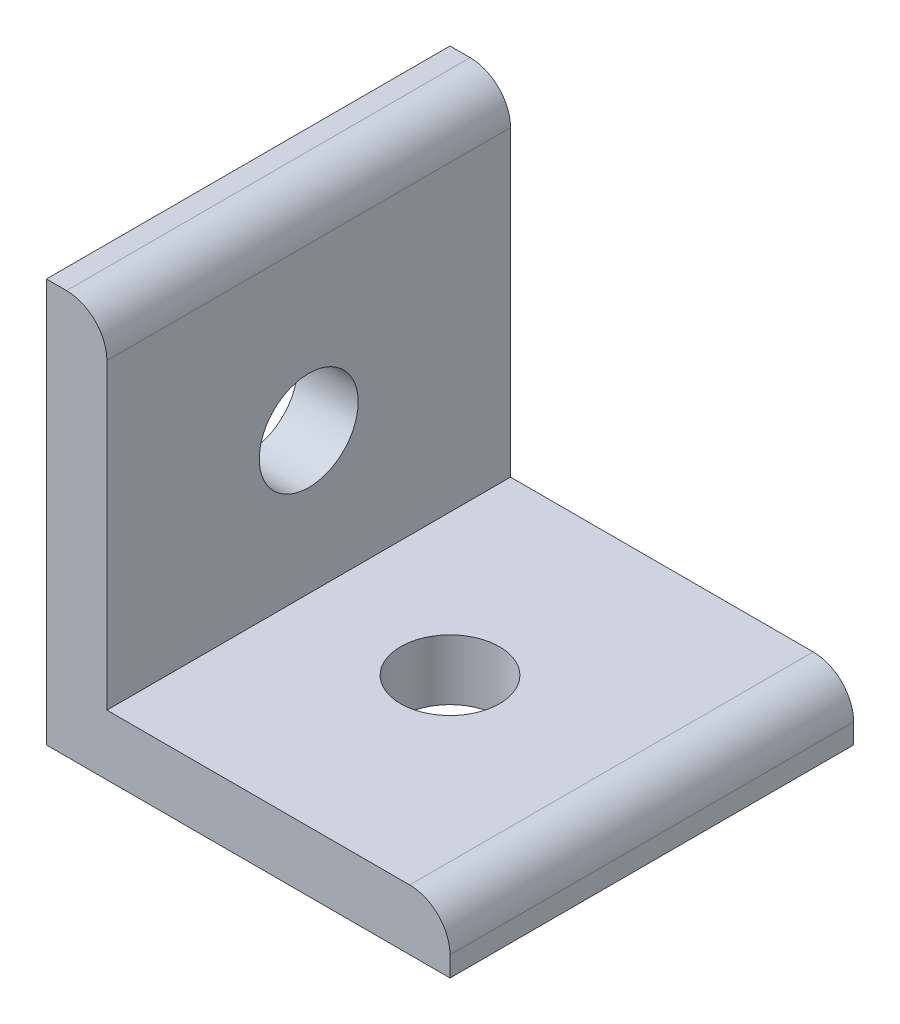
ISO-10303-21;
HEADER;
FILE_DESCRIPTION(('STEP AP214'),'2;1');
FILE_NAME('part.step','',(''),(''),'','','');
FILE_SCHEMA(('AUTOMOTIVE_DESIGN { 1 0 10303 214 1 1 1 1 }'));
ENDSEC;
DATA;
#1=APPLICATION_CONTEXT('core data for automotive mechanical design processes');
#2=APPLICATION_PROTOCOL_DEFINITION('international standard','automotive_design',2000,#1);
#3=PRODUCT_CONTEXT('',#1,'mechanical');
#4=PRODUCT('Part','Part','',(#3));
#5=PRODUCT_RELATED_PRODUCT_CATEGORY('part','',(#4));
#6=PRODUCT_DEFINITION_FORMATION('','',#4);
#7=PRODUCT_DEFINITION_CONTEXT('part definition',#1,'design');
#8=PRODUCT_DEFINITION('design','',#6,#7);
#9=PRODUCT_DEFINITION_SHAPE('','',#8);
#10=(LENGTH_UNIT() NAMED_UNIT(*) SI_UNIT(.MILLI.,.METRE.));
#11=(NAMED_UNIT(*) PLANE_ANGLE_UNIT() SI_UNIT($,.RADIAN.));
#12=(NAMED_UNIT(*) SI_UNIT($,.STERADIAN.) SOLID_ANGLE_UNIT());
#13=UNCERTAINTY_MEASURE_WITH_UNIT(LENGTH_MEASURE(1.E-05),#10,'distance_accuracy_value','');
#14=(GEOMETRIC_REPRESENTATION_CONTEXT(3) GLOBAL_UNCERTAINTY_ASSIGNED_CONTEXT((#13)) GLOBAL_UNIT_ASSIGNED_CONTEXT((#10,
#11,#12)) REPRESENTATION_CONTEXT('',''));
#15=CARTESIAN_POINT('',(0.,0.,0.));
#16=DIRECTION('',(0.,0.,1.));
#17=DIRECTION('',(1.,0.,0.));
#18=AXIS2_PLACEMENT_3D('',#15,#16,#17);
#19=CARTESIAN_POINT('',(0.,0.,20.));
#20=DIRECTION('',(1.,0.,0.));
#21=DIRECTION('',(0.,0.,-1.));
#22=AXIS2_PLACEMENT_3D('',#19,#20,#21);
#23=PLANE('',#22);
#24=CARTESIAN_POINT('',(0.,9.99686990070358,10.));
#25=DIRECTION('',(1.,0.,0.));
#26=DIRECTION('',(0.,0.,-1.));
#27=AXIS2_PLACEMENT_3D('',#24,#25,#26);
#28=CIRCLE('',#27,2.45);
#29=CARTESIAN_POINT('',(0.,9.99686990070358,7.55));
#30=VERTEX_POINT('',#29);
#31=EDGE_CURVE('E174',#30,#30,#28,.F.);
#32=ORIENTED_EDGE('',*,*,#31,.F.);
#33=EDGE_LOOP('',(#32));
#34=FACE_BOUND('',#33,.T.);
#35=DIRECTION('',(0.,-1.,0.));
#36=VECTOR('',#35,1.);
#37=CARTESIAN_POINT('',(0.,0.,0.));
#38=LINE('',#37,#36);
#39=CARTESIAN_POINT('',(0.,19.9968699007036,0.));
#40=VERTEX_POINT('',#39);
#41=CARTESIAN_POINT('',(0.,0.,0.));
#42=VERTEX_POINT('',#41);
#43=EDGE_CURVE('E121',#40,#42,#38,.T.);
#44=ORIENTED_EDGE('',*,*,#43,.T.);
#45=DIRECTION('',(0.,0.,-1.));
#46=VECTOR('',#45,1.);
#47=CARTESIAN_POINT('',(0.,0.,20.));
#48=LINE('',#47,#46);
#49=CARTESIAN_POINT('',(0.,0.,20.));
#50=VERTEX_POINT('',#49);
#51=EDGE_CURVE('E103',#50,#42,#48,.T.);
#52=ORIENTED_EDGE('',*,*,#51,.F.);
#53=DIRECTION('',(0.,-1.,0.));
#54=VECTOR('',#53,1.);
#55=CARTESIAN_POINT('',(0.,0.,20.));
#56=LINE('',#55,#54);
#57=CARTESIAN_POINT('',(0.,19.9968699007036,20.));
#58=VERTEX_POINT('',#57);
#59=EDGE_CURVE('E109',#58,#50,#56,.T.);
#60=ORIENTED_EDGE('',*,*,#59,.F.);
#61=DIRECTION('',(0.,0.,-1.));
#62=VECTOR('',#61,1.);
#63=CARTESIAN_POINT('',(0.,19.9968699007036,20.));
#64=LINE('',#63,#62);
#65=EDGE_CURVE('E161',#58,#40,#64,.T.);
#66=ORIENTED_EDGE('',*,*,#65,.T.);
#67=EDGE_LOOP('',(#44,#52,#60,#66));
#68=FACE_BOUND('',#67,.T.);
#69=ADVANCED_FACE('F34',(#34,#68),#23,.F.);
#70=CARTESIAN_POINT('',(0.,0.,20.));
#71=DIRECTION('',(0.,1.,0.));
#72=DIRECTION('',(0.,0.,1.));
#73=AXIS2_PLACEMENT_3D('',#70,#71,#72);
#74=PLANE('',#73);
#75=CARTESIAN_POINT('',(10.0015933342515,0.,10.));
#76=DIRECTION('',(0.,1.,0.));
#77=DIRECTION('',(0.,0.,1.));
#78=AXIS2_PLACEMENT_3D('',#75,#76,#77);
#79=CIRCLE('',#78,2.45);
#80=CARTESIAN_POINT('',(10.0015933342515,0.,12.45));
#81=VERTEX_POINT('',#80);
#82=EDGE_CURVE('E182',#81,#81,#79,.F.);
#83=ORIENTED_EDGE('',*,*,#82,.F.);
#84=EDGE_LOOP('',(#83));
#85=FACE_BOUND('',#84,.T.);
#86=DIRECTION('',(1.,0.,0.));
#87=VECTOR('',#86,1.);
#88=CARTESIAN_POINT('',(0.,0.,0.));
#89=LINE('',#88,#87);
#90=CARTESIAN_POINT('',(20.0015933342515,0.,0.));
#91=VERTEX_POINT('',#90);
#92=EDGE_CURVE('E156',#42,#91,#89,.T.);
#93=ORIENTED_EDGE('',*,*,#92,.T.);
#94=DIRECTION('',(0.,0.,-1.));
#95=VECTOR('',#94,1.);
#96=CARTESIAN_POINT('',(20.0015933342515,0.,20.));
#97=LINE('',#96,#95);
#98=CARTESIAN_POINT('',(20.0015933342515,0.,20.));
#99=VERTEX_POINT('',#98);
#100=EDGE_CURVE('E106',#99,#91,#97,.T.);
#101=ORIENTED_EDGE('',*,*,#100,.F.);
#102=DIRECTION('',(1.,0.,0.));
#103=VECTOR('',#102,1.);
#104=CARTESIAN_POINT('',(0.,0.,20.));
#105=LINE('',#104,#103);
#106=EDGE_CURVE('E99',#50,#99,#105,.T.);
#107=ORIENTED_EDGE('',*,*,#106,.F.);
#108=ORIENTED_EDGE('',*,*,#51,.T.);
#109=EDGE_LOOP('',(#93,#101,#107,#108));
#110=FACE_BOUND('',#109,.T.);
#111=ADVANCED_FACE('F101',(#85,#110),#74,.F.);
#112=CARTESIAN_POINT('',(20.0015933342515,2.99443825189407,20.));
#113=DIRECTION('',(-1.,0.,0.));
#114=DIRECTION('',(0.,0.,1.));
#115=AXIS2_PLACEMENT_3D('',#112,#113,#114);
#116=PLANE('',#115);
#117=DIRECTION('',(0.,1.,0.));
#118=VECTOR('',#117,1.);
#119=CARTESIAN_POINT('',(20.0015933342515,2.99443825189407,0.));
#120=LINE('',#119,#118);
#121=CARTESIAN_POINT('',(20.0015933342515,0.994438251894074,0.));
#122=VERTEX_POINT('',#121);
#123=EDGE_CURVE('E153',#91,#122,#120,.T.);
#124=ORIENTED_EDGE('',*,*,#123,.T.);
#125=DIRECTION('',(0.,0.,-1.));
#126=VECTOR('',#125,1.);
#127=CARTESIAN_POINT('',(20.0015933342515,0.994438251894074,20.));
#128=LINE('',#127,#126);
#129=CARTESIAN_POINT('',(20.0015933342515,0.994438251894074,20.));
#130=VERTEX_POINT('',#129);
#131=EDGE_CURVE('E42',#122,#130,#128,.F.);
#132=ORIENTED_EDGE('',*,*,#131,.T.);
#133=DIRECTION('',(0.,1.,0.));
#134=VECTOR('',#133,1.);
#135=CARTESIAN_POINT('',(20.0015933342515,2.99443825189407,20.));
#136=LINE('',#135,#134);
#137=EDGE_CURVE('E108',#99,#130,#136,.T.);
#138=ORIENTED_EDGE('',*,*,#137,.F.);
#139=ORIENTED_EDGE('',*,*,#100,.T.);
#140=EDGE_LOOP('',(#124,#132,#138,#139));
#141=FACE_BOUND('',#140,.T.);
#142=ADVANCED_FACE('F175',(#141),#116,.F.);
#143=CARTESIAN_POINT('',(2.999161685442,2.99443825189407,20.));
#144=DIRECTION('',(0.,-1.,0.));
#145=DIRECTION('',(0.,0.,-1.));
#146=AXIS2_PLACEMENT_3D('',#143,#144,#145);
#147=PLANE('',#146);
#148=CARTESIAN_POINT('',(10.0015933342515,2.99443825189407,10.));
#149=DIRECTION('',(0.,1.,0.));
#150=DIRECTION('',(0.,0.,1.));
#151=AXIS2_PLACEMENT_3D('',#148,#149,#150);
#152=CIRCLE('',#151,2.45);
#153=CARTESIAN_POINT('',(10.0015933342515,2.99443825189407,12.45));
#154=VERTEX_POINT('',#153);
#155=EDGE_CURVE('E185',#154,#154,#152,.T.);
#156=ORIENTED_EDGE('',*,*,#155,.F.);
#157=EDGE_LOOP('',(#156));
#158=FACE_BOUND('',#157,.T.);
#159=DIRECTION('',(-1.,0.,0.));
#160=VECTOR('',#159,1.);
#161=CARTESIAN_POINT('',(2.999161685442,2.99443825189407,20.));
#162=LINE('',#161,#160);
#163=CARTESIAN_POINT('',(18.0015933342515,2.99443825189407,20.));
#164=VERTEX_POINT('',#163);
#165=CARTESIAN_POINT('',(2.999161685442,2.99443825189407,20.));
#166=VERTEX_POINT('',#165);
#167=EDGE_CURVE('E146',#164,#166,#162,.T.);
#168=ORIENTED_EDGE('',*,*,#167,.F.);
#169=DIRECTION('',(0.,0.,-1.));
#170=VECTOR('',#169,1.);
#171=CARTESIAN_POINT('',(18.0015933342515,2.99443825189407,20.));
#172=LINE('',#171,#170);
#173=CARTESIAN_POINT('',(18.0015933342515,2.99443825189407,0.));
#174=VERTEX_POINT('',#173);
#175=EDGE_CURVE('E136',#164,#174,#172,.T.);
#176=ORIENTED_EDGE('',*,*,#175,.T.);
#177=DIRECTION('',(-1.,0.,0.));
#178=VECTOR('',#177,1.);
#179=CARTESIAN_POINT('',(2.999161685442,2.99443825189407,0.));
#180=LINE('',#179,#178);
#181=CARTESIAN_POINT('',(2.999161685442,2.99443825189407,0.));
#182=VERTEX_POINT('',#181);
#183=EDGE_CURVE('E144',#174,#182,#180,.T.);
#184=ORIENTED_EDGE('',*,*,#183,.T.);
#185=DIRECTION('',(0.,0.,-1.));
#186=VECTOR('',#185,1.);
#187=CARTESIAN_POINT('',(2.999161685442,2.99443825189407,20.));
#188=LINE('',#187,#186);
#189=EDGE_CURVE('E127',#166,#182,#188,.T.);
#190=ORIENTED_EDGE('',*,*,#189,.F.);
#191=EDGE_LOOP('',(#168,#176,#184,#190));
#192=FACE_BOUND('',#191,.T.);
#193=ADVANCED_FACE('F142',(#158,#192),#147,.F.);
#194=CARTESIAN_POINT('',(2.999161685442,19.9968699007036,20.));
#195=DIRECTION('',(-1.,0.,0.));
#196=DIRECTION('',(0.,0.,1.));
#197=AXIS2_PLACEMENT_3D('',#194,#195,#196);
#198=PLANE('',#197);
#199=CARTESIAN_POINT('',(2.999161685442,9.99686990070358,10.));
#200=DIRECTION('',(1.,0.,0.));
#201=DIRECTION('',(0.,0.,-1.));
#202=AXIS2_PLACEMENT_3D('',#199,#200,#201);
#203=CIRCLE('',#202,2.45);
#204=CARTESIAN_POINT('',(2.999161685442,9.99686990070358,7.55));
#205=VERTEX_POINT('',#204);
#206=EDGE_CURVE('E179',#205,#205,#203,.T.);
#207=ORIENTED_EDGE('',*,*,#206,.F.);
#208=EDGE_LOOP('',(#207));
#209=FACE_BOUND('',#208,.T.);
#210=DIRECTION('',(0.,1.,0.));
#211=VECTOR('',#210,1.);
#212=CARTESIAN_POINT('',(2.999161685442,19.9968699007036,0.));
#213=LINE('',#212,#211);
#214=CARTESIAN_POINT('',(2.999161685442,17.9968699007036,0.));
#215=VERTEX_POINT('',#214);
#216=EDGE_CURVE('E152',#182,#215,#213,.T.);
#217=ORIENTED_EDGE('',*,*,#216,.T.);
#218=DIRECTION('',(0.,0.,-1.));
#219=VECTOR('',#218,1.);
#220=CARTESIAN_POINT('',(2.999161685442,17.9968699007036,20.));
#221=LINE('',#220,#219);
#222=CARTESIAN_POINT('',(2.999161685442,17.9968699007036,20.));
#223=VERTEX_POINT('',#222);
#224=EDGE_CURVE('E132',#215,#223,#221,.F.);
#225=ORIENTED_EDGE('',*,*,#224,.T.);
#226=DIRECTION('',(0.,1.,0.));
#227=VECTOR('',#226,1.);
#228=CARTESIAN_POINT('',(2.999161685442,19.9968699007036,20.));
#229=LINE('',#228,#227);
#230=EDGE_CURVE('E167',#166,#223,#229,.T.);
#231=ORIENTED_EDGE('',*,*,#230,.F.);
#232=ORIENTED_EDGE('',*,*,#189,.T.);
#233=EDGE_LOOP('',(#217,#225,#231,#232));
#234=FACE_BOUND('',#233,.T.);
#235=ADVANCED_FACE('F164',(#209,#234),#198,.F.);
#236=CARTESIAN_POINT('',(0.,19.9968699007036,20.));
#237=DIRECTION('',(0.,-1.,0.));
#238=DIRECTION('',(0.,0.,-1.));
#239=AXIS2_PLACEMENT_3D('',#236,#237,#238);
#240=PLANE('',#239);
#241=DIRECTION('',(-1.,0.,0.));
#242=VECTOR('',#241,1.);
#243=CARTESIAN_POINT('',(0.,19.9968699007036,20.));
#244=LINE('',#243,#242);
#245=CARTESIAN_POINT('',(0.999161685442002,19.9968699007036,20.));
#246=VERTEX_POINT('',#245);
#247=EDGE_CURVE('E114',#246,#58,#244,.T.);
#248=ORIENTED_EDGE('',*,*,#247,.F.);
#249=DIRECTION('',(0.,0.,-1.));
#250=VECTOR('',#249,1.);
#251=CARTESIAN_POINT('',(0.999161685442002,19.9968699007036,20.));
#252=LINE('',#251,#250);
#253=CARTESIAN_POINT('',(0.999161685442002,19.9968699007036,0.));
#254=VERTEX_POINT('',#253);
#255=EDGE_CURVE('E122',#246,#254,#252,.T.);
#256=ORIENTED_EDGE('',*,*,#255,.T.);
#257=DIRECTION('',(-1.,0.,0.));
#258=VECTOR('',#257,1.);
#259=CARTESIAN_POINT('',(0.,19.9968699007036,0.));
#260=LINE('',#259,#258);
#261=EDGE_CURVE('E118',#254,#40,#260,.T.);
#262=ORIENTED_EDGE('',*,*,#261,.T.);
#263=ORIENTED_EDGE('',*,*,#65,.F.);
#264=EDGE_LOOP('',(#248,#256,#262,#263));
#265=FACE_BOUND('',#264,.T.);
#266=ADVANCED_FACE('F197',(#265),#240,.F.);
#267=CARTESIAN_POINT('',(0.,0.,20.));
#268=DIRECTION('',(0.,0.,-1.));
#269=DIRECTION('',(-1.,0.,0.));
#270=AXIS2_PLACEMENT_3D('',#267,#268,#269);
#271=PLANE('',#270);
#272=ORIENTED_EDGE('',*,*,#137,.T.);
#273=CARTESIAN_POINT('',(18.0015933342515,0.994438251894074,20.));
#274=DIRECTION('',(0.,0.,-1.));
#275=DIRECTION('',(-1.,0.,0.));
#276=AXIS2_PLACEMENT_3D('',#273,#274,#275);
#277=CIRCLE('',#276,2.);
#278=EDGE_CURVE('E11',#130,#164,#277,.F.);
#279=ORIENTED_EDGE('',*,*,#278,.T.);
#280=ORIENTED_EDGE('',*,*,#167,.T.);
#281=ORIENTED_EDGE('',*,*,#230,.T.);
#282=CARTESIAN_POINT('',(0.999161685442002,17.9968699007036,20.));
#283=DIRECTION('',(0.,0.,-1.));
#284=DIRECTION('',(-1.,0.,0.));
#285=AXIS2_PLACEMENT_3D('',#282,#283,#284);
#286=CIRCLE('',#285,2.);
#287=EDGE_CURVE('E134',#223,#246,#286,.F.);
#288=ORIENTED_EDGE('',*,*,#287,.T.);
#289=ORIENTED_EDGE('',*,*,#247,.T.);
#290=ORIENTED_EDGE('',*,*,#59,.T.);
#291=ORIENTED_EDGE('',*,*,#106,.T.);
#292=EDGE_LOOP('',(#272,#279,#280,#281,#288,#289,#290,#291));
#293=FACE_BOUND('',#292,.T.);
#294=ADVANCED_FACE('F112',(#293),#271,.F.);
#295=CARTESIAN_POINT('',(0.,0.,0.));
#296=DIRECTION('',(0.,0.,-1.));
#297=DIRECTION('',(-1.,0.,0.));
#298=AXIS2_PLACEMENT_3D('',#295,#296,#297);
#299=PLANE('',#298);
#300=ORIENTED_EDGE('',*,*,#183,.F.);
#301=CARTESIAN_POINT('',(18.0015933342515,0.994438251894074,0.));
#302=DIRECTION('',(0.,0.,-1.));
#303=DIRECTION('',(-1.,0.,0.));
#304=AXIS2_PLACEMENT_3D('',#301,#302,#303);
#305=CIRCLE('',#304,2.);
#306=EDGE_CURVE('E56',#174,#122,#305,.T.);
#307=ORIENTED_EDGE('',*,*,#306,.T.);
#308=ORIENTED_EDGE('',*,*,#123,.F.);
#309=ORIENTED_EDGE('',*,*,#92,.F.);
#310=ORIENTED_EDGE('',*,*,#43,.F.);
#311=ORIENTED_EDGE('',*,*,#261,.F.);
#312=CARTESIAN_POINT('',(0.999161685442002,17.9968699007036,0.));
#313=DIRECTION('',(0.,0.,-1.));
#314=DIRECTION('',(-1.,0.,0.));
#315=AXIS2_PLACEMENT_3D('',#312,#313,#314);
#316=CIRCLE('',#315,2.);
#317=EDGE_CURVE('E125',#254,#215,#316,.T.);
#318=ORIENTED_EDGE('',*,*,#317,.T.);
#319=ORIENTED_EDGE('',*,*,#216,.F.);
#320=EDGE_LOOP('',(#300,#307,#308,#309,#310,#311,#318,#319));
#321=FACE_BOUND('',#320,.T.);
#322=ADVANCED_FACE('F150',(#321),#299,.T.);
#323=CARTESIAN_POINT('',(-6.92964645562817,9.99686990070358,10.));
#324=DIRECTION('',(1.,0.,0.));
#325=DIRECTION('',(0.,0.,-1.));
#326=AXIS2_PLACEMENT_3D('',#323,#324,#325);
#327=CYLINDRICAL_SURFACE('',#326,2.45);
#328=ORIENTED_EDGE('',*,*,#31,.T.);
#329=EDGE_LOOP('',(#328));
#330=FACE_BOUND('',#329,.T.);
#331=ORIENTED_EDGE('',*,*,#206,.T.);
#332=EDGE_LOOP('',(#331));
#333=FACE_BOUND('',#332,.T.);
#334=ADVANCED_FACE('F217',(#330,#333),#327,.F.);
#335=CARTESIAN_POINT('',(10.0015933342515,-6.92964645562817,10.));
#336=DIRECTION('',(0.,1.,0.));
#337=DIRECTION('',(0.,0.,1.));
#338=AXIS2_PLACEMENT_3D('',#335,#336,#337);
#339=CYLINDRICAL_SURFACE('',#338,2.45);
#340=ORIENTED_EDGE('',*,*,#82,.T.);
#341=EDGE_LOOP('',(#340));
#342=FACE_BOUND('',#341,.T.);
#343=ORIENTED_EDGE('',*,*,#155,.T.);
#344=EDGE_LOOP('',(#343));
#345=FACE_BOUND('',#344,.T.);
#346=ADVANCED_FACE('F189',(#342,#345),#339,.F.);
#347=CARTESIAN_POINT('',(0.999161685442002,17.9968699007036,20.));
#348=DIRECTION('',(0.,0.,-1.));
#349=DIRECTION('',(-1.,0.,0.));
#350=AXIS2_PLACEMENT_3D('',#347,#348,#349);
#351=CYLINDRICAL_SURFACE('',#350,2.);
#352=ORIENTED_EDGE('',*,*,#287,.F.);
#353=ORIENTED_EDGE('',*,*,#224,.F.);
#354=ORIENTED_EDGE('',*,*,#317,.F.);
#355=ORIENTED_EDGE('',*,*,#255,.F.);
#356=EDGE_LOOP('',(#352,#353,#354,#355));
#357=FACE_BOUND('',#356,.T.);
#358=ADVANCED_FACE('F210',(#357),#351,.T.);
#359=CARTESIAN_POINT('',(18.0015933342515,0.994438251894074,20.));
#360=DIRECTION('',(0.,0.,-1.));
#361=DIRECTION('',(-1.,0.,0.));
#362=AXIS2_PLACEMENT_3D('',#359,#360,#361);
#363=CYLINDRICAL_SURFACE('',#362,2.);
#364=ORIENTED_EDGE('',*,*,#278,.F.);
#365=ORIENTED_EDGE('',*,*,#131,.F.);
#366=ORIENTED_EDGE('',*,*,#306,.F.);
#367=ORIENTED_EDGE('',*,*,#175,.F.);
#368=EDGE_LOOP('',(#364,#365,#366,#367));
#369=FACE_BOUND('',#368,.T.);
#370=ADVANCED_FACE('F36',(#369),#363,.T.);
#371=CLOSED_SHELL('',(#69,#111,#142,#193,#235,#266,#294,#322,#334,#346,#358,#370));
#372=MANIFOLD_SOLID_BREP('B2',#371);
#373=ADVANCED_BREP_SHAPE_REPRESENTATION('',(#18,#372),#14);
#374=SHAPE_DEFINITION_REPRESENTATION(#9,#373);
ENDSEC;
END-ISO-10303-21;
